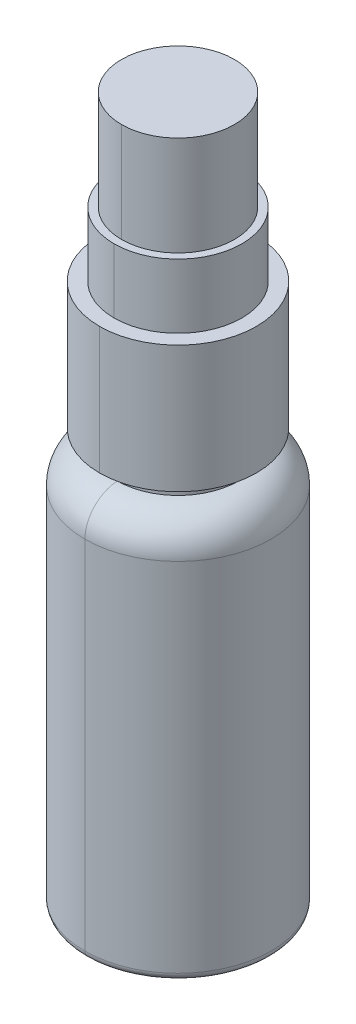
ISO-10303-21;
HEADER;
FILE_DESCRIPTION(('STEP AP214'),'2;1');
FILE_NAME('part.step','',(''),(''),'','','');
FILE_SCHEMA(('AUTOMOTIVE_DESIGN { 1 0 10303 214 1 1 1 1 }'));
ENDSEC;
DATA;
#1=APPLICATION_CONTEXT('core data for automotive mechanical design processes');
#2=APPLICATION_PROTOCOL_DEFINITION('international standard','automotive_design',2000,#1);
#3=PRODUCT_CONTEXT('',#1,'mechanical');
#4=PRODUCT('Part','Part','',(#3));
#5=PRODUCT_RELATED_PRODUCT_CATEGORY('part','',(#4));
#6=PRODUCT_DEFINITION_FORMATION('','',#4);
#7=PRODUCT_DEFINITION_CONTEXT('part definition',#1,'design');
#8=PRODUCT_DEFINITION('design','',#6,#7);
#9=PRODUCT_DEFINITION_SHAPE('','',#8);
#10=(LENGTH_UNIT() NAMED_UNIT(*) SI_UNIT(.MILLI.,.METRE.));
#11=(NAMED_UNIT(*) PLANE_ANGLE_UNIT() SI_UNIT($,.RADIAN.));
#12=(NAMED_UNIT(*) SI_UNIT($,.STERADIAN.) SOLID_ANGLE_UNIT());
#13=UNCERTAINTY_MEASURE_WITH_UNIT(LENGTH_MEASURE(1.E-05),#10,'distance_accuracy_value','');
#14=(GEOMETRIC_REPRESENTATION_CONTEXT(3) GLOBAL_UNCERTAINTY_ASSIGNED_CONTEXT((#13)) GLOBAL_UNIT_ASSIGNED_CONTEXT((#10,
#11,#12)) REPRESENTATION_CONTEXT('',''));
#15=CARTESIAN_POINT('',(0.,0.,0.));
#16=DIRECTION('',(0.,0.,1.));
#17=DIRECTION('',(1.,0.,0.));
#18=AXIS2_PLACEMENT_3D('',#15,#16,#17);
#19=CARTESIAN_POINT('',(0.,46.5,0.));
#20=DIRECTION('',(0.,1.,0.));
#21=DIRECTION('',(0.,0.,1.));
#22=AXIS2_PLACEMENT_3D('',#19,#20,#21);
#23=TOROIDAL_SURFACE('',#22,7.5,4.375);
#24=CARTESIAN_POINT('',(0.,46.5,-7.5));
#25=DIRECTION('',(1.,0.,0.));
#26=DIRECTION('',(0.,0.,-1.));
#27=AXIS2_PLACEMENT_3D('',#24,#25,#26);
#28=CIRCLE('',#27,4.375);
#29=CARTESIAN_POINT('',(0.,46.5,-11.875));
#30=VERTEX_POINT('',#29);
#31=CARTESIAN_POINT('',(0.,50.875,-7.5));
#32=VERTEX_POINT('',#31);
#33=EDGE_CURVE('E360',#30,#32,#28,.T.);
#34=ORIENTED_EDGE('',*,*,#33,.F.);
#35=CARTESIAN_POINT('',(0.,46.5,0.));
#36=DIRECTION('',(0.,1.,0.));
#37=DIRECTION('',(0.,0.,1.));
#38=AXIS2_PLACEMENT_3D('',#35,#36,#37);
#39=CIRCLE('',#38,11.875);
#40=CARTESIAN_POINT('',(0.,46.5,11.875));
#41=VERTEX_POINT('',#40);
#42=EDGE_CURVE('E10',#30,#41,#39,.T.);
#43=ORIENTED_EDGE('',*,*,#42,.T.);
#44=CARTESIAN_POINT('',(0.,46.5,7.5));
#45=DIRECTION('',(-1.,0.,0.));
#46=DIRECTION('',(0.,0.,1.));
#47=AXIS2_PLACEMENT_3D('',#44,#45,#46);
#48=CIRCLE('',#47,4.375);
#49=CARTESIAN_POINT('',(0.,50.875,7.5));
#50=VERTEX_POINT('',#49);
#51=EDGE_CURVE('E200',#41,#50,#48,.T.);
#52=ORIENTED_EDGE('',*,*,#51,.T.);
#53=CARTESIAN_POINT('',(0.,50.875,0.));
#54=DIRECTION('',(0.,1.,0.));
#55=DIRECTION('',(0.,0.,1.));
#56=AXIS2_PLACEMENT_3D('',#53,#54,#55);
#57=CIRCLE('',#56,7.5);
#58=EDGE_CURVE('E246',#32,#50,#57,.T.);
#59=ORIENTED_EDGE('',*,*,#58,.F.);
#60=EDGE_LOOP('',(#34,#43,#52,#59));
#61=FACE_BOUND('',#60,.T.);
#62=ADVANCED_FACE('F16',(#61),#23,.T.);
#63=CARTESIAN_POINT('',(0.,65.8,0.));
#64=DIRECTION('',(0.,1.,0.));
#65=DIRECTION('',(0.,0.,1.));
#66=AXIS2_PLACEMENT_3D('',#63,#64,#65);
#67=CYLINDRICAL_SURFACE('',#66,11.875);
#68=DIRECTION('',(0.,1.,0.));
#69=VECTOR('',#68,1.);
#70=CARTESIAN_POINT('',(0.,65.8,-11.875));
#71=LINE('',#70,#69);
#72=CARTESIAN_POINT('',(0.,1.,-11.875));
#73=VERTEX_POINT('',#72);
#74=EDGE_CURVE('E191',#73,#30,#71,.T.);
#75=ORIENTED_EDGE('',*,*,#74,.F.);
#76=CARTESIAN_POINT('',(0.,1.,0.));
#77=DIRECTION('',(0.,1.,0.));
#78=DIRECTION('',(0.,0.,1.));
#79=AXIS2_PLACEMENT_3D('',#76,#77,#78);
#80=CIRCLE('',#79,11.875);
#81=CARTESIAN_POINT('',(0.,1.,11.875));
#82=VERTEX_POINT('',#81);
#83=EDGE_CURVE('E25',#73,#82,#80,.T.);
#84=ORIENTED_EDGE('',*,*,#83,.T.);
#85=DIRECTION('',(0.,1.,0.));
#86=VECTOR('',#85,1.);
#87=CARTESIAN_POINT('',(0.,65.8,11.875));
#88=LINE('',#87,#86);
#89=EDGE_CURVE('E196',#82,#41,#88,.T.);
#90=ORIENTED_EDGE('',*,*,#89,.T.);
#91=ORIENTED_EDGE('',*,*,#42,.F.);
#92=EDGE_LOOP('',(#75,#84,#90,#91));
#93=FACE_BOUND('',#92,.T.);
#94=ADVANCED_FACE('F18',(#93),#67,.T.);
#95=CARTESIAN_POINT('',(0.,1.,0.));
#96=DIRECTION('',(0.,1.,0.));
#97=DIRECTION('',(0.,0.,1.));
#98=AXIS2_PLACEMENT_3D('',#95,#96,#97);
#99=TOROIDAL_SURFACE('',#98,10.875,1.);
#100=CARTESIAN_POINT('',(0.,1.,-10.875));
#101=DIRECTION('',(1.,0.,0.));
#102=DIRECTION('',(0.,0.,-1.));
#103=AXIS2_PLACEMENT_3D('',#100,#101,#102);
#104=CIRCLE('',#103,1.);
#105=CARTESIAN_POINT('',(0.,0.,-10.875));
#106=VERTEX_POINT('',#105);
#107=EDGE_CURVE('E170',#106,#73,#104,.T.);
#108=ORIENTED_EDGE('',*,*,#107,.F.);
#109=CARTESIAN_POINT('',(0.,0.,0.));
#110=DIRECTION('',(0.,1.,0.));
#111=DIRECTION('',(0.,0.,1.));
#112=AXIS2_PLACEMENT_3D('',#109,#110,#111);
#113=CIRCLE('',#112,10.875);
#114=CARTESIAN_POINT('',(0.,0.,10.875));
#115=VERTEX_POINT('',#114);
#116=EDGE_CURVE('E179',#106,#115,#113,.T.);
#117=ORIENTED_EDGE('',*,*,#116,.T.);
#118=CARTESIAN_POINT('',(0.,1.,10.875));
#119=DIRECTION('',(-1.,0.,0.));
#120=DIRECTION('',(0.,0.,1.));
#121=AXIS2_PLACEMENT_3D('',#118,#119,#120);
#122=CIRCLE('',#121,1.);
#123=EDGE_CURVE('E173',#115,#82,#122,.T.);
#124=ORIENTED_EDGE('',*,*,#123,.T.);
#125=ORIENTED_EDGE('',*,*,#83,.F.);
#126=EDGE_LOOP('',(#108,#117,#124,#125));
#127=FACE_BOUND('',#126,.T.);
#128=ADVANCED_FACE('F169',(#127),#99,.T.);
#129=CARTESIAN_POINT('',(9.75,0.,0.));
#130=DIRECTION('',(0.,1.,0.));
#131=DIRECTION('',(1.,0.,0.));
#132=AXIS2_PLACEMENT_3D('',#129,#130,#131);
#133=PLANE('',#132);
#134=CARTESIAN_POINT('',(0.,0.,0.));
#135=DIRECTION('',(0.,1.,0.));
#136=DIRECTION('',(0.,0.,1.));
#137=AXIS2_PLACEMENT_3D('',#134,#135,#136);
#138=CIRCLE('',#137,9.75);
#139=CARTESIAN_POINT('',(0.,0.,9.75));
#140=VERTEX_POINT('',#139);
#141=CARTESIAN_POINT('',(0.,0.,-9.75));
#142=VERTEX_POINT('',#141);
#143=EDGE_CURVE('E226',#140,#142,#138,.T.);
#144=ORIENTED_EDGE('',*,*,#143,.T.);
#145=CARTESIAN_POINT('',(0.,0.,0.));
#146=DIRECTION('',(0.,1.,0.));
#147=DIRECTION('',(0.,0.,1.));
#148=AXIS2_PLACEMENT_3D('',#145,#146,#147);
#149=CIRCLE('',#148,9.75);
#150=EDGE_CURVE('E346',#142,#140,#149,.T.);
#151=ORIENTED_EDGE('',*,*,#150,.T.);
#152=EDGE_LOOP('',(#144,#151));
#153=FACE_BOUND('',#152,.T.);
#154=CARTESIAN_POINT('',(0.,0.,0.));
#155=DIRECTION('',(0.,1.,0.));
#156=DIRECTION('',(0.,0.,1.));
#157=AXIS2_PLACEMENT_3D('',#154,#155,#156);
#158=CIRCLE('',#157,10.875);
#159=EDGE_CURVE('E187',#115,#106,#158,.T.);
#160=ORIENTED_EDGE('',*,*,#159,.F.);
#161=ORIENTED_EDGE('',*,*,#116,.F.);
#162=EDGE_LOOP('',(#160,#161));
#163=FACE_BOUND('',#162,.T.);
#164=ADVANCED_FACE('F399',(#153,#163),#133,.F.);
#165=CARTESIAN_POINT('',(0.,1.,0.));
#166=DIRECTION('',(0.,1.,0.));
#167=DIRECTION('',(0.,0.,1.));
#168=AXIS2_PLACEMENT_3D('',#165,#166,#167);
#169=TOROIDAL_SURFACE('',#168,9.75,1.);
#170=CARTESIAN_POINT('',(0.,1.,-9.75));
#171=DIRECTION('',(1.,0.,0.));
#172=DIRECTION('',(0.,0.,-1.));
#173=AXIS2_PLACEMENT_3D('',#170,#171,#172);
#174=CIRCLE('',#173,1.);
#175=CARTESIAN_POINT('',(0.,1.,-8.75));
#176=VERTEX_POINT('',#175);
#177=EDGE_CURVE('E230',#176,#142,#174,.T.);
#178=ORIENTED_EDGE('',*,*,#177,.F.);
#179=CARTESIAN_POINT('',(0.,1.,0.));
#180=DIRECTION('',(0.,1.,0.));
#181=DIRECTION('',(0.,0.,1.));
#182=AXIS2_PLACEMENT_3D('',#179,#180,#181);
#183=CIRCLE('',#182,8.75);
#184=CARTESIAN_POINT('',(0.,1.,8.75));
#185=VERTEX_POINT('',#184);
#186=EDGE_CURVE('E211',#176,#185,#183,.T.);
#187=ORIENTED_EDGE('',*,*,#186,.T.);
#188=CARTESIAN_POINT('',(0.,1.,9.75));
#189=DIRECTION('',(-1.,0.,0.));
#190=DIRECTION('',(0.,0.,1.));
#191=AXIS2_PLACEMENT_3D('',#188,#189,#190);
#192=CIRCLE('',#191,1.);
#193=EDGE_CURVE('E216',#185,#140,#192,.T.);
#194=ORIENTED_EDGE('',*,*,#193,.T.);
#195=ORIENTED_EDGE('',*,*,#150,.F.);
#196=EDGE_LOOP('',(#178,#187,#194,#195));
#197=FACE_BOUND('',#196,.T.);
#198=ADVANCED_FACE('F398',(#197),#169,.T.);
#199=CARTESIAN_POINT('',(0.,65.8,0.));
#200=DIRECTION('',(0.,1.,0.));
#201=DIRECTION('',(0.,0.,1.));
#202=AXIS2_PLACEMENT_3D('',#199,#200,#201);
#203=CYLINDRICAL_SURFACE('',#202,8.75);
#204=DIRECTION('',(0.,1.,0.));
#205=VECTOR('',#204,1.);
#206=CARTESIAN_POINT('',(0.,65.8,-8.75));
#207=LINE('',#206,#205);
#208=CARTESIAN_POINT('',(0.,1.40955855165527,-8.75));
#209=VERTEX_POINT('',#208);
#210=EDGE_CURVE('E215',#176,#209,#207,.T.);
#211=ORIENTED_EDGE('',*,*,#210,.F.);
#212=CARTESIAN_POINT('',(0.,1.,0.));
#213=DIRECTION('',(0.,1.,0.));
#214=DIRECTION('',(0.,0.,1.));
#215=AXIS2_PLACEMENT_3D('',#212,#213,#214);
#216=CIRCLE('',#215,8.75);
#217=EDGE_CURVE('E233',#185,#176,#216,.T.);
#218=ORIENTED_EDGE('',*,*,#217,.F.);
#219=DIRECTION('',(0.,1.,0.));
#220=VECTOR('',#219,1.);
#221=CARTESIAN_POINT('',(0.,65.8,8.75));
#222=LINE('',#221,#220);
#223=CARTESIAN_POINT('',(0.,1.40955855165527,8.75));
#224=VERTEX_POINT('',#223);
#225=EDGE_CURVE('E239',#185,#224,#222,.T.);
#226=ORIENTED_EDGE('',*,*,#225,.T.);
#227=CARTESIAN_POINT('',(0.,1.40955855165527,0.));
#228=DIRECTION('',(0.,1.,0.));
#229=DIRECTION('',(0.,0.,1.));
#230=AXIS2_PLACEMENT_3D('',#227,#228,#229);
#231=CIRCLE('',#230,8.75);
#232=EDGE_CURVE('E345',#224,#209,#231,.T.);
#233=ORIENTED_EDGE('',*,*,#232,.T.);
#234=EDGE_LOOP('',(#211,#218,#226,#233));
#235=FACE_BOUND('',#234,.T.);
#236=ADVANCED_FACE('F393',(#235),#203,.F.);
#237=CARTESIAN_POINT('',(0.,1.40955855165527,0.));
#238=DIRECTION('',(0.,1.,0.));
#239=DIRECTION('',(0.,0.,1.));
#240=AXIS2_PLACEMENT_3D('',#237,#238,#239);
#241=TOROIDAL_SURFACE('',#240,7.75,1.);
#242=CARTESIAN_POINT('',(0.,1.40955855165527,-7.75));
#243=DIRECTION('',(1.,0.,0.));
#244=DIRECTION('',(0.,0.,-1.));
#245=AXIS2_PLACEMENT_3D('',#242,#243,#244);
#246=CIRCLE('',#245,1.);
#247=CARTESIAN_POINT('',(0.,2.40955855165527,-7.75));
#248=VERTEX_POINT('',#247);
#249=EDGE_CURVE('E234',#209,#248,#246,.T.);
#250=ORIENTED_EDGE('',*,*,#249,.F.);
#251=ORIENTED_EDGE('',*,*,#232,.F.);
#252=CARTESIAN_POINT('',(0.,1.40955855165527,7.75));
#253=DIRECTION('',(-1.,0.,0.));
#254=DIRECTION('',(0.,0.,1.));
#255=AXIS2_PLACEMENT_3D('',#252,#253,#254);
#256=CIRCLE('',#255,1.);
#257=CARTESIAN_POINT('',(0.,2.40955855165527,7.75));
#258=VERTEX_POINT('',#257);
#259=EDGE_CURVE('E272',#224,#258,#256,.T.);
#260=ORIENTED_EDGE('',*,*,#259,.T.);
#261=CARTESIAN_POINT('',(0.,2.40955855165527,0.));
#262=DIRECTION('',(0.,1.,0.));
#263=DIRECTION('',(0.,0.,1.));
#264=AXIS2_PLACEMENT_3D('',#261,#262,#263);
#265=CIRCLE('',#264,7.75);
#266=EDGE_CURVE('E343',#258,#248,#265,.T.);
#267=ORIENTED_EDGE('',*,*,#266,.T.);
#268=EDGE_LOOP('',(#250,#251,#260,#267));
#269=FACE_BOUND('',#268,.T.);
#270=ADVANCED_FACE('F420',(#269),#241,.F.);
#271=CARTESIAN_POINT('',(7.75,2.40955855165527,0.));
#272=DIRECTION('',(0.,-1.,0.));
#273=DIRECTION('',(0.,0.,-1.));
#274=AXIS2_PLACEMENT_3D('',#271,#272,#273);
#275=PLANE('',#274);
#276=ORIENTED_EDGE('',*,*,#266,.F.);
#277=CARTESIAN_POINT('',(0.,2.40955855165527,0.));
#278=DIRECTION('',(0.,1.,0.));
#279=DIRECTION('',(0.,0.,1.));
#280=AXIS2_PLACEMENT_3D('',#277,#278,#279);
#281=CIRCLE('',#280,7.75);
#282=EDGE_CURVE('E238',#248,#258,#281,.T.);
#283=ORIENTED_EDGE('',*,*,#282,.F.);
#284=EDGE_LOOP('',(#276,#283));
#285=FACE_BOUND('',#284,.T.);
#286=ADVANCED_FACE('F421',(#285),#275,.T.);
#287=CARTESIAN_POINT('',(0.,89.975,0.));
#288=DIRECTION('',(0.,1.,0.));
#289=DIRECTION('',(1.,0.,0.));
#290=AXIS2_PLACEMENT_3D('',#287,#288,#289);
#291=PLANE('',#290);
#292=CARTESIAN_POINT('',(0.,89.975,0.));
#293=DIRECTION('',(0.,1.,0.));
#294=DIRECTION('',(0.,0.,1.));
#295=AXIS2_PLACEMENT_3D('',#292,#293,#294);
#296=CIRCLE('',#295,7.2);
#297=CARTESIAN_POINT('',(0.,89.975,7.2));
#298=VERTEX_POINT('',#297);
#299=CARTESIAN_POINT('',(0.,89.975,-7.2));
#300=VERTEX_POINT('',#299);
#301=EDGE_CURVE('E248',#298,#300,#296,.T.);
#302=ORIENTED_EDGE('',*,*,#301,.T.);
#303=CARTESIAN_POINT('',(0.,89.975,0.));
#304=DIRECTION('',(0.,1.,0.));
#305=DIRECTION('',(0.,0.,1.));
#306=AXIS2_PLACEMENT_3D('',#303,#304,#305);
#307=CIRCLE('',#306,7.2);
#308=EDGE_CURVE('E261',#300,#298,#307,.T.);
#309=ORIENTED_EDGE('',*,*,#308,.T.);
#310=EDGE_LOOP('',(#302,#309));
#311=FACE_BOUND('',#310,.T.);
#312=ADVANCED_FACE('F424',(#311),#291,.T.);
#313=CARTESIAN_POINT('',(0.,65.8,0.));
#314=DIRECTION('',(0.,1.,0.));
#315=DIRECTION('',(0.,0.,1.));
#316=AXIS2_PLACEMENT_3D('',#313,#314,#315);
#317=CYLINDRICAL_SURFACE('',#316,7.2);
#318=DIRECTION('',(0.,1.,0.));
#319=VECTOR('',#318,1.);
#320=CARTESIAN_POINT('',(0.,65.8,-7.2));
#321=LINE('',#320,#319);
#322=CARTESIAN_POINT('',(0.,77.275,-7.2));
#323=VERTEX_POINT('',#322);
#324=EDGE_CURVE('E253',#323,#300,#321,.T.);
#325=ORIENTED_EDGE('',*,*,#324,.F.);
#326=CARTESIAN_POINT('',(0.,77.275,0.));
#327=DIRECTION('',(0.,1.,0.));
#328=DIRECTION('',(0.,0.,1.));
#329=AXIS2_PLACEMENT_3D('',#326,#327,#328);
#330=CIRCLE('',#329,7.2);
#331=CARTESIAN_POINT('',(0.,77.275,7.2));
#332=VERTEX_POINT('',#331);
#333=EDGE_CURVE('E258',#323,#332,#330,.T.);
#334=ORIENTED_EDGE('',*,*,#333,.T.);
#335=DIRECTION('',(0.,1.,0.));
#336=VECTOR('',#335,1.);
#337=CARTESIAN_POINT('',(0.,65.8,7.2));
#338=LINE('',#337,#336);
#339=EDGE_CURVE('E252',#332,#298,#338,.T.);
#340=ORIENTED_EDGE('',*,*,#339,.T.);
#341=ORIENTED_EDGE('',*,*,#308,.F.);
#342=EDGE_LOOP('',(#325,#334,#340,#341));
#343=FACE_BOUND('',#342,.T.);
#344=ADVANCED_FACE('F428',(#343),#317,.T.);
#345=CARTESIAN_POINT('',(8.15,77.275,0.));
#346=DIRECTION('',(0.,-1.,0.));
#347=DIRECTION('',(0.,0.,-1.));
#348=AXIS2_PLACEMENT_3D('',#345,#346,#347);
#349=PLANE('',#348);
#350=CARTESIAN_POINT('',(0.,77.275,0.));
#351=DIRECTION('',(0.,1.,0.));
#352=DIRECTION('',(0.,0.,1.));
#353=AXIS2_PLACEMENT_3D('',#350,#351,#352);
#354=CIRCLE('',#353,7.2);
#355=EDGE_CURVE('E276',#332,#323,#354,.T.);
#356=ORIENTED_EDGE('',*,*,#355,.F.);
#357=ORIENTED_EDGE('',*,*,#333,.F.);
#358=EDGE_LOOP('',(#356,#357));
#359=FACE_BOUND('',#358,.T.);
#360=CARTESIAN_POINT('',(0.,77.275,0.));
#361=DIRECTION('',(0.,1.,0.));
#362=DIRECTION('',(0.,0.,1.));
#363=AXIS2_PLACEMENT_3D('',#360,#361,#362);
#364=CIRCLE('',#363,8.15);
#365=CARTESIAN_POINT('',(0.,77.275,8.15));
#366=VERTEX_POINT('',#365);
#367=CARTESIAN_POINT('',(0.,77.275,-8.15));
#368=VERTEX_POINT('',#367);
#369=EDGE_CURVE('E294',#366,#368,#364,.T.);
#370=ORIENTED_EDGE('',*,*,#369,.T.);
#371=CARTESIAN_POINT('',(0.,77.275,0.));
#372=DIRECTION('',(0.,1.,0.));
#373=DIRECTION('',(0.,0.,1.));
#374=AXIS2_PLACEMENT_3D('',#371,#372,#373);
#375=CIRCLE('',#374,8.15);
#376=EDGE_CURVE('E262',#368,#366,#375,.T.);
#377=ORIENTED_EDGE('',*,*,#376,.T.);
#378=EDGE_LOOP('',(#370,#377));
#379=FACE_BOUND('',#378,.T.);
#380=ADVANCED_FACE('F432',(#359,#379),#349,.F.);
#381=CARTESIAN_POINT('',(0.,65.8,0.));
#382=DIRECTION('',(0.,1.,0.));
#383=DIRECTION('',(0.,0.,1.));
#384=AXIS2_PLACEMENT_3D('',#381,#382,#383);
#385=CYLINDRICAL_SURFACE('',#384,8.15);
#386=DIRECTION('',(0.,1.,0.));
#387=VECTOR('',#386,1.);
#388=CARTESIAN_POINT('',(0.,65.8,-8.15));
#389=LINE('',#388,#387);
#390=CARTESIAN_POINT('',(0.,69.075,-8.15));
#391=VERTEX_POINT('',#390);
#392=EDGE_CURVE('E290',#391,#368,#389,.T.);
#393=ORIENTED_EDGE('',*,*,#392,.F.);
#394=CARTESIAN_POINT('',(0.,69.075,0.));
#395=DIRECTION('',(0.,1.,0.));
#396=DIRECTION('',(0.,0.,1.));
#397=AXIS2_PLACEMENT_3D('',#394,#395,#396);
#398=CIRCLE('',#397,8.15);
#399=CARTESIAN_POINT('',(0.,69.075,8.15));
#400=VERTEX_POINT('',#399);
#401=EDGE_CURVE('E220',#391,#400,#398,.T.);
#402=ORIENTED_EDGE('',*,*,#401,.T.);
#403=DIRECTION('',(0.,1.,0.));
#404=VECTOR('',#403,1.);
#405=CARTESIAN_POINT('',(0.,65.8,8.15));
#406=LINE('',#405,#404);
#407=EDGE_CURVE('E298',#400,#366,#406,.T.);
#408=ORIENTED_EDGE('',*,*,#407,.T.);
#409=ORIENTED_EDGE('',*,*,#376,.F.);
#410=EDGE_LOOP('',(#393,#402,#408,#409));
#411=FACE_BOUND('',#410,.T.);
#412=ADVANCED_FACE('F436',(#411),#385,.T.);
#413=CARTESIAN_POINT('',(10.,69.075,0.));
#414=DIRECTION('',(0.,-1.,0.));
#415=DIRECTION('',(0.,0.,-1.));
#416=AXIS2_PLACEMENT_3D('',#413,#414,#415);
#417=PLANE('',#416);
#418=CARTESIAN_POINT('',(0.,69.075,0.));
#419=DIRECTION('',(0.,1.,0.));
#420=DIRECTION('',(0.,0.,1.));
#421=AXIS2_PLACEMENT_3D('',#418,#419,#420);
#422=CIRCLE('',#421,8.15);
#423=EDGE_CURVE('E286',#400,#391,#422,.T.);
#424=ORIENTED_EDGE('',*,*,#423,.F.);
#425=ORIENTED_EDGE('',*,*,#401,.F.);
#426=EDGE_LOOP('',(#424,#425));
#427=FACE_BOUND('',#426,.T.);
#428=CARTESIAN_POINT('',(0.,69.075,0.));
#429=DIRECTION('',(0.,1.,0.));
#430=DIRECTION('',(0.,0.,1.));
#431=AXIS2_PLACEMENT_3D('',#428,#429,#430);
#432=CIRCLE('',#431,10.);
#433=CARTESIAN_POINT('',(0.,69.075,10.));
#434=VERTEX_POINT('',#433);
#435=CARTESIAN_POINT('',(0.,69.075,-10.));
#436=VERTEX_POINT('',#435);
#437=EDGE_CURVE('E310',#434,#436,#432,.T.);
#438=ORIENTED_EDGE('',*,*,#437,.T.);
#439=CARTESIAN_POINT('',(0.,69.075,0.));
#440=DIRECTION('',(0.,1.,0.));
#441=DIRECTION('',(0.,0.,1.));
#442=AXIS2_PLACEMENT_3D('',#439,#440,#441);
#443=CIRCLE('',#442,10.);
#444=EDGE_CURVE('E217',#436,#434,#443,.T.);
#445=ORIENTED_EDGE('',*,*,#444,.T.);
#446=EDGE_LOOP('',(#438,#445));
#447=FACE_BOUND('',#446,.T.);
#448=ADVANCED_FACE('F438',(#427,#447),#417,.F.);
#449=CARTESIAN_POINT('',(0.,65.8,0.));
#450=DIRECTION('',(0.,1.,0.));
#451=DIRECTION('',(0.,0.,1.));
#452=AXIS2_PLACEMENT_3D('',#449,#450,#451);
#453=CYLINDRICAL_SURFACE('',#452,10.);
#454=DIRECTION('',(0.,1.,0.));
#455=VECTOR('',#454,1.);
#456=CARTESIAN_POINT('',(0.,65.8,-10.));
#457=LINE('',#456,#455);
#458=CARTESIAN_POINT('',(0.,52.875,-10.));
#459=VERTEX_POINT('',#458);
#460=EDGE_CURVE('E306',#459,#436,#457,.T.);
#461=ORIENTED_EDGE('',*,*,#460,.F.);
#462=CARTESIAN_POINT('',(0.,52.875,0.));
#463=DIRECTION('',(0.,1.,0.));
#464=DIRECTION('',(0.,0.,1.));
#465=AXIS2_PLACEMENT_3D('',#462,#463,#464);
#466=CIRCLE('',#465,10.);
#467=CARTESIAN_POINT('',(0.,52.875,10.));
#468=VERTEX_POINT('',#467);
#469=EDGE_CURVE('E221',#459,#468,#466,.T.);
#470=ORIENTED_EDGE('',*,*,#469,.T.);
#471=DIRECTION('',(0.,1.,0.));
#472=VECTOR('',#471,1.);
#473=CARTESIAN_POINT('',(0.,65.8,10.));
#474=LINE('',#473,#472);
#475=EDGE_CURVE('E314',#468,#434,#474,.T.);
#476=ORIENTED_EDGE('',*,*,#475,.T.);
#477=ORIENTED_EDGE('',*,*,#444,.F.);
#478=EDGE_LOOP('',(#461,#470,#476,#477));
#479=FACE_BOUND('',#478,.T.);
#480=ADVANCED_FACE('F441',(#479),#453,.T.);
#481=CARTESIAN_POINT('',(7.75,52.875,0.));
#482=DIRECTION('',(0.,1.,0.));
#483=DIRECTION('',(1.,0.,0.));
#484=AXIS2_PLACEMENT_3D('',#481,#482,#483);
#485=PLANE('',#484);
#486=CARTESIAN_POINT('',(0.,52.875,0.));
#487=DIRECTION('',(0.,1.,0.));
#488=DIRECTION('',(0.,0.,1.));
#489=AXIS2_PLACEMENT_3D('',#486,#487,#488);
#490=CIRCLE('',#489,7.75);
#491=CARTESIAN_POINT('',(0.,52.875,7.75));
#492=VERTEX_POINT('',#491);
#493=CARTESIAN_POINT('',(0.,52.875,-7.75));
#494=VERTEX_POINT('',#493);
#495=EDGE_CURVE('E326',#492,#494,#490,.T.);
#496=ORIENTED_EDGE('',*,*,#495,.T.);
#497=CARTESIAN_POINT('',(0.,52.875,0.));
#498=DIRECTION('',(0.,1.,0.));
#499=DIRECTION('',(0.,0.,1.));
#500=AXIS2_PLACEMENT_3D('',#497,#498,#499);
#501=CIRCLE('',#500,7.75);
#502=EDGE_CURVE('E37',#494,#492,#501,.T.);
#503=ORIENTED_EDGE('',*,*,#502,.T.);
#504=EDGE_LOOP('',(#496,#503));
#505=FACE_BOUND('',#504,.T.);
#506=CARTESIAN_POINT('',(0.,52.875,0.));
#507=DIRECTION('',(0.,1.,0.));
#508=DIRECTION('',(0.,0.,1.));
#509=AXIS2_PLACEMENT_3D('',#506,#507,#508);
#510=CIRCLE('',#509,10.);
#511=EDGE_CURVE('E302',#468,#459,#510,.T.);
#512=ORIENTED_EDGE('',*,*,#511,.F.);
#513=ORIENTED_EDGE('',*,*,#469,.F.);
#514=EDGE_LOOP('',(#512,#513));
#515=FACE_BOUND('',#514,.T.);
#516=ADVANCED_FACE('F443',(#505,#515),#485,.F.);
#517=CARTESIAN_POINT('',(0.,65.8,0.));
#518=DIRECTION('',(0.,1.,0.));
#519=DIRECTION('',(0.,0.,1.));
#520=AXIS2_PLACEMENT_3D('',#517,#518,#519);
#521=CYLINDRICAL_SURFACE('',#520,7.75);
#522=DIRECTION('',(0.,1.,0.));
#523=VECTOR('',#522,1.);
#524=CARTESIAN_POINT('',(0.,65.8,-7.75));
#525=LINE('',#524,#523);
#526=CARTESIAN_POINT('',(0.,50.875,-7.75));
#527=VERTEX_POINT('',#526);
#528=EDGE_CURVE('E322',#527,#494,#525,.T.);
#529=ORIENTED_EDGE('',*,*,#528,.F.);
#530=CARTESIAN_POINT('',(0.,50.875,0.));
#531=DIRECTION('',(0.,1.,0.));
#532=DIRECTION('',(0.,0.,1.));
#533=AXIS2_PLACEMENT_3D('',#530,#531,#532);
#534=CIRCLE('',#533,7.75);
#535=CARTESIAN_POINT('',(0.,50.875,7.75));
#536=VERTEX_POINT('',#535);
#537=EDGE_CURVE('E243',#527,#536,#534,.T.);
#538=ORIENTED_EDGE('',*,*,#537,.T.);
#539=DIRECTION('',(0.,1.,0.));
#540=VECTOR('',#539,1.);
#541=CARTESIAN_POINT('',(0.,65.8,7.75));
#542=LINE('',#541,#540);
#543=EDGE_CURVE('E247',#536,#492,#542,.T.);
#544=ORIENTED_EDGE('',*,*,#543,.T.);
#545=ORIENTED_EDGE('',*,*,#502,.F.);
#546=EDGE_LOOP('',(#529,#538,#544,#545));
#547=FACE_BOUND('',#546,.T.);
#548=ADVANCED_FACE('F446',(#547),#521,.T.);
#549=CARTESIAN_POINT('',(7.5,50.875,0.));
#550=DIRECTION('',(0.,1.,0.));
#551=DIRECTION('',(1.,0.,0.));
#552=AXIS2_PLACEMENT_3D('',#549,#550,#551);
#553=PLANE('',#552);
#554=CARTESIAN_POINT('',(0.,50.875,0.));
#555=DIRECTION('',(0.,1.,0.));
#556=DIRECTION('',(0.,0.,1.));
#557=AXIS2_PLACEMENT_3D('',#554,#555,#556);
#558=CIRCLE('',#557,7.5);
#559=EDGE_CURVE('E207',#50,#32,#558,.T.);
#560=ORIENTED_EDGE('',*,*,#559,.T.);
#561=ORIENTED_EDGE('',*,*,#58,.T.);
#562=EDGE_LOOP('',(#560,#561));
#563=FACE_BOUND('',#562,.T.);
#564=CARTESIAN_POINT('',(0.,50.875,0.));
#565=DIRECTION('',(0.,1.,0.));
#566=DIRECTION('',(0.,0.,1.));
#567=AXIS2_PLACEMENT_3D('',#564,#565,#566);
#568=CIRCLE('',#567,7.75);
#569=EDGE_CURVE('E318',#536,#527,#568,.T.);
#570=ORIENTED_EDGE('',*,*,#569,.F.);
#571=ORIENTED_EDGE('',*,*,#537,.F.);
#572=EDGE_LOOP('',(#570,#571));
#573=FACE_BOUND('',#572,.T.);
#574=ADVANCED_FACE('F452',(#563,#573),#553,.F.);
#575=CARTESIAN_POINT('',(0.,65.8,0.));
#576=DIRECTION('',(0.,1.,0.));
#577=DIRECTION('',(0.,0.,1.));
#578=AXIS2_PLACEMENT_3D('',#575,#576,#577);
#579=CYLINDRICAL_SURFACE('',#578,7.75);
#580=ORIENTED_EDGE('',*,*,#569,.T.);
#581=ORIENTED_EDGE('',*,*,#528,.T.);
#582=ORIENTED_EDGE('',*,*,#495,.F.);
#583=ORIENTED_EDGE('',*,*,#543,.F.);
#584=EDGE_LOOP('',(#580,#581,#582,#583));
#585=FACE_BOUND('',#584,.T.);
#586=ADVANCED_FACE('F454',(#585),#579,.T.);
#587=CARTESIAN_POINT('',(0.,65.8,0.));
#588=DIRECTION('',(0.,1.,0.));
#589=DIRECTION('',(0.,0.,1.));
#590=AXIS2_PLACEMENT_3D('',#587,#588,#589);
#591=CYLINDRICAL_SURFACE('',#590,10.);
#592=ORIENTED_EDGE('',*,*,#511,.T.);
#593=ORIENTED_EDGE('',*,*,#460,.T.);
#594=ORIENTED_EDGE('',*,*,#437,.F.);
#595=ORIENTED_EDGE('',*,*,#475,.F.);
#596=EDGE_LOOP('',(#592,#593,#594,#595));
#597=FACE_BOUND('',#596,.T.);
#598=ADVANCED_FACE('F459',(#597),#591,.T.);
#599=CARTESIAN_POINT('',(0.,65.8,0.));
#600=DIRECTION('',(0.,1.,0.));
#601=DIRECTION('',(0.,0.,1.));
#602=AXIS2_PLACEMENT_3D('',#599,#600,#601);
#603=CYLINDRICAL_SURFACE('',#602,8.15);
#604=ORIENTED_EDGE('',*,*,#423,.T.);
#605=ORIENTED_EDGE('',*,*,#392,.T.);
#606=ORIENTED_EDGE('',*,*,#369,.F.);
#607=ORIENTED_EDGE('',*,*,#407,.F.);
#608=EDGE_LOOP('',(#604,#605,#606,#607));
#609=FACE_BOUND('',#608,.T.);
#610=ADVANCED_FACE('F475',(#609),#603,.T.);
#611=CARTESIAN_POINT('',(0.,65.8,0.));
#612=DIRECTION('',(0.,1.,0.));
#613=DIRECTION('',(0.,0.,1.));
#614=AXIS2_PLACEMENT_3D('',#611,#612,#613);
#615=CYLINDRICAL_SURFACE('',#614,7.2);
#616=ORIENTED_EDGE('',*,*,#355,.T.);
#617=ORIENTED_EDGE('',*,*,#324,.T.);
#618=ORIENTED_EDGE('',*,*,#301,.F.);
#619=ORIENTED_EDGE('',*,*,#339,.F.);
#620=EDGE_LOOP('',(#616,#617,#618,#619));
#621=FACE_BOUND('',#620,.T.);
#622=ADVANCED_FACE('F480',(#621),#615,.T.);
#623=CARTESIAN_POINT('',(0.,1.40955855165527,0.));
#624=DIRECTION('',(0.,1.,0.));
#625=DIRECTION('',(0.,0.,1.));
#626=AXIS2_PLACEMENT_3D('',#623,#624,#625);
#627=TOROIDAL_SURFACE('',#626,7.75,1.);
#628=CARTESIAN_POINT('',(0.,1.40955855165527,0.));
#629=DIRECTION('',(0.,1.,0.));
#630=DIRECTION('',(0.,0.,1.));
#631=AXIS2_PLACEMENT_3D('',#628,#629,#630);
#632=CIRCLE('',#631,8.75);
#633=EDGE_CURVE('E257',#209,#224,#632,.T.);
#634=ORIENTED_EDGE('',*,*,#633,.F.);
#635=ORIENTED_EDGE('',*,*,#249,.T.);
#636=ORIENTED_EDGE('',*,*,#282,.T.);
#637=ORIENTED_EDGE('',*,*,#259,.F.);
#638=EDGE_LOOP('',(#634,#635,#636,#637));
#639=FACE_BOUND('',#638,.T.);
#640=ADVANCED_FACE('F491',(#639),#627,.F.);
#641=CARTESIAN_POINT('',(0.,65.8,0.));
#642=DIRECTION('',(0.,1.,0.));
#643=DIRECTION('',(0.,0.,1.));
#644=AXIS2_PLACEMENT_3D('',#641,#642,#643);
#645=CYLINDRICAL_SURFACE('',#644,8.75);
#646=ORIENTED_EDGE('',*,*,#186,.F.);
#647=ORIENTED_EDGE('',*,*,#210,.T.);
#648=ORIENTED_EDGE('',*,*,#633,.T.);
#649=ORIENTED_EDGE('',*,*,#225,.F.);
#650=EDGE_LOOP('',(#646,#647,#648,#649));
#651=FACE_BOUND('',#650,.T.);
#652=ADVANCED_FACE('F396',(#651),#645,.F.);
#653=CARTESIAN_POINT('',(0.,1.,0.));
#654=DIRECTION('',(0.,1.,0.));
#655=DIRECTION('',(0.,0.,1.));
#656=AXIS2_PLACEMENT_3D('',#653,#654,#655);
#657=TOROIDAL_SURFACE('',#656,9.75,1.);
#658=ORIENTED_EDGE('',*,*,#217,.T.);
#659=ORIENTED_EDGE('',*,*,#177,.T.);
#660=ORIENTED_EDGE('',*,*,#143,.F.);
#661=ORIENTED_EDGE('',*,*,#193,.F.);
#662=EDGE_LOOP('',(#658,#659,#660,#661));
#663=FACE_BOUND('',#662,.T.);
#664=ADVANCED_FACE('F390',(#663),#657,.T.);
#665=CARTESIAN_POINT('',(0.,1.,0.));
#666=DIRECTION('',(0.,1.,0.));
#667=DIRECTION('',(0.,0.,1.));
#668=AXIS2_PLACEMENT_3D('',#665,#666,#667);
#669=TOROIDAL_SURFACE('',#668,10.875,1.);
#670=ORIENTED_EDGE('',*,*,#159,.T.);
#671=ORIENTED_EDGE('',*,*,#107,.T.);
#672=CARTESIAN_POINT('',(0.,1.,0.));
#673=DIRECTION('',(0.,1.,0.));
#674=DIRECTION('',(0.,0.,1.));
#675=AXIS2_PLACEMENT_3D('',#672,#673,#674);
#676=CIRCLE('',#675,11.875);
#677=EDGE_CURVE('E185',#82,#73,#676,.T.);
#678=ORIENTED_EDGE('',*,*,#677,.F.);
#679=ORIENTED_EDGE('',*,*,#123,.F.);
#680=EDGE_LOOP('',(#670,#671,#678,#679));
#681=FACE_BOUND('',#680,.T.);
#682=ADVANCED_FACE('F183',(#681),#669,.T.);
#683=CARTESIAN_POINT('',(0.,65.8,0.));
#684=DIRECTION('',(0.,1.,0.));
#685=DIRECTION('',(0.,0.,1.));
#686=AXIS2_PLACEMENT_3D('',#683,#684,#685);
#687=CYLINDRICAL_SURFACE('',#686,11.875);
#688=ORIENTED_EDGE('',*,*,#677,.T.);
#689=ORIENTED_EDGE('',*,*,#74,.T.);
#690=CARTESIAN_POINT('',(0.,46.5,0.));
#691=DIRECTION('',(0.,1.,0.));
#692=DIRECTION('',(0.,0.,1.));
#693=AXIS2_PLACEMENT_3D('',#690,#691,#692);
#694=CIRCLE('',#693,11.875);
#695=EDGE_CURVE('E370',#41,#30,#694,.T.);
#696=ORIENTED_EDGE('',*,*,#695,.F.);
#697=ORIENTED_EDGE('',*,*,#89,.F.);
#698=EDGE_LOOP('',(#688,#689,#696,#697));
#699=FACE_BOUND('',#698,.T.);
#700=ADVANCED_FACE('F198',(#699),#687,.T.);
#701=CARTESIAN_POINT('',(0.,46.5,0.));
#702=DIRECTION('',(0.,1.,0.));
#703=DIRECTION('',(0.,0.,1.));
#704=AXIS2_PLACEMENT_3D('',#701,#702,#703);
#705=TOROIDAL_SURFACE('',#704,7.5,4.375);
#706=ORIENTED_EDGE('',*,*,#695,.T.);
#707=ORIENTED_EDGE('',*,*,#33,.T.);
#708=ORIENTED_EDGE('',*,*,#559,.F.);
#709=ORIENTED_EDGE('',*,*,#51,.F.);
#710=EDGE_LOOP('',(#706,#707,#708,#709));
#711=FACE_BOUND('',#710,.T.);
#712=ADVANCED_FACE('F484',(#711),#705,.T.);
#713=CLOSED_SHELL('',(#62,#94,#128,#164,#198,#236,#270,#286,#312,#344,#380,#412,#448,#480,#516,
#548,#574,#586,#598,#610,#622,#640,#652,#664,#682,#700,#712));
#714=MANIFOLD_SOLID_BREP('B1',#713);
#715=ADVANCED_BREP_SHAPE_REPRESENTATION('',(#18,#714),#14);
#716=SHAPE_DEFINITION_REPRESENTATION(#9,#715);
ENDSEC;
END-ISO-10303-21;
